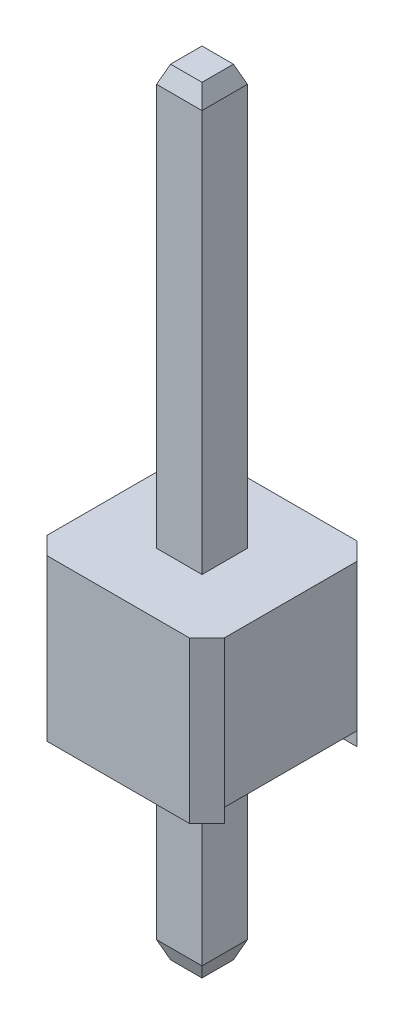
ISO-10303-21;
HEADER;
FILE_DESCRIPTION(('STEP AP214'),'2;1');
FILE_NAME('part.step','',(''),(''),'','','');
FILE_SCHEMA(('AUTOMOTIVE_DESIGN { 1 0 10303 214 1 1 1 1 }'));
ENDSEC;
DATA;
#1=APPLICATION_CONTEXT('core data for automotive mechanical design processes');
#2=APPLICATION_PROTOCOL_DEFINITION('international standard','automotive_design',2000,#1);
#3=PRODUCT_CONTEXT('',#1,'mechanical');
#4=PRODUCT('Part','Part','',(#3));
#5=PRODUCT_RELATED_PRODUCT_CATEGORY('part','',(#4));
#6=PRODUCT_DEFINITION_FORMATION('','',#4);
#7=PRODUCT_DEFINITION_CONTEXT('part definition',#1,'design');
#8=PRODUCT_DEFINITION('design','',#6,#7);
#9=PRODUCT_DEFINITION_SHAPE('','',#8);
#10=(LENGTH_UNIT() NAMED_UNIT(*) SI_UNIT(.MILLI.,.METRE.));
#11=(NAMED_UNIT(*) PLANE_ANGLE_UNIT() SI_UNIT($,.RADIAN.));
#12=(NAMED_UNIT(*) SI_UNIT($,.STERADIAN.) SOLID_ANGLE_UNIT());
#13=UNCERTAINTY_MEASURE_WITH_UNIT(LENGTH_MEASURE(1.E-05),#10,'distance_accuracy_value','');
#14=(GEOMETRIC_REPRESENTATION_CONTEXT(3) GLOBAL_UNCERTAINTY_ASSIGNED_CONTEXT((#13)) GLOBAL_UNIT_ASSIGNED_CONTEXT((#10,
#11,#12)) REPRESENTATION_CONTEXT('',''));
#15=CARTESIAN_POINT('',(0.,0.,0.));
#16=DIRECTION('',(0.,0.,1.));
#17=DIRECTION('',(1.,0.,0.));
#18=AXIS2_PLACEMENT_3D('',#15,#16,#17);
#19=CARTESIAN_POINT('',(-4.405,3.2,1.275));
#20=DIRECTION('',(0.,1.,0.));
#21=DIRECTION('',(0.,0.,1.));
#22=AXIS2_PLACEMENT_3D('',#19,#20,#21);
#23=PLANE('',#22);
#24=DIRECTION('',(0.,0.,-1.));
#25=VECTOR('',#24,1.);
#26=CARTESIAN_POINT('',(-0.945,3.2,-0.875));
#27=LINE('',#26,#25);
#28=CARTESIAN_POINT('',(-0.945000000000002,3.2,1.275));
#29=VERTEX_POINT('',#28);
#30=CARTESIAN_POINT('',(-0.945000000000005,3.2,-0.624999999999996));
#31=VERTEX_POINT('',#30);
#32=EDGE_CURVE('E232',#29,#31,#27,.T.);
#33=ORIENTED_EDGE('',*,*,#32,.T.);
#34=DIRECTION('',(1.,0.,0.));
#35=VECTOR('',#34,1.);
#36=CARTESIAN_POINT('',(-4.405,3.2,-0.624999999999996));
#37=LINE('',#36,#35);
#38=CARTESIAN_POINT('',(1.595,3.2,-0.624999999999996));
#39=VERTEX_POINT('',#38);
#40=EDGE_CURVE('E235',#31,#39,#37,.T.);
#41=ORIENTED_EDGE('',*,*,#40,.T.);
#42=DIRECTION('',(0.,0.,1.));
#43=VECTOR('',#42,1.);
#44=CARTESIAN_POINT('',(1.595,3.2,1.275));
#45=LINE('',#44,#43);
#46=CARTESIAN_POINT('',(1.595,3.2,1.275));
#47=VERTEX_POINT('',#46);
#48=EDGE_CURVE('E389',#39,#47,#45,.T.);
#49=ORIENTED_EDGE('',*,*,#48,.T.);
#50=DIRECTION('',(1.,0.,0.));
#51=VECTOR('',#50,1.);
#52=CARTESIAN_POINT('',(-4.405,3.2,1.275));
#53=LINE('',#52,#51);
#54=EDGE_CURVE('E305',#29,#47,#53,.T.);
#55=ORIENTED_EDGE('',*,*,#54,.F.);
#56=EDGE_LOOP('',(#33,#41,#49,#55));
#57=FACE_BOUND('',#56,.T.);
#58=DIRECTION('',(0.,0.,-1.));
#59=VECTOR('',#58,1.);
#60=CARTESIAN_POINT('',(0.,3.2,0.));
#61=LINE('',#60,#59);
#62=CARTESIAN_POINT('',(0.,3.2,0.65));
#63=VERTEX_POINT('',#62);
#64=CARTESIAN_POINT('',(0.,3.2,0.));
#65=VERTEX_POINT('',#64);
#66=EDGE_CURVE('E194',#63,#65,#61,.T.);
#67=ORIENTED_EDGE('',*,*,#66,.F.);
#68=DIRECTION('',(-1.,0.,0.));
#69=VECTOR('',#68,1.);
#70=CARTESIAN_POINT('',(0.,3.2,0.65));
#71=LINE('',#70,#69);
#72=CARTESIAN_POINT('',(0.65,3.2,0.65));
#73=VERTEX_POINT('',#72);
#74=EDGE_CURVE('E202',#73,#63,#71,.T.);
#75=ORIENTED_EDGE('',*,*,#74,.F.);
#76=DIRECTION('',(0.,0.,1.));
#77=VECTOR('',#76,1.);
#78=CARTESIAN_POINT('',(0.65,3.2,0.));
#79=LINE('',#78,#77);
#80=CARTESIAN_POINT('',(0.65,3.2,0.));
#81=VERTEX_POINT('',#80);
#82=EDGE_CURVE('E215',#81,#73,#79,.T.);
#83=ORIENTED_EDGE('',*,*,#82,.F.);
#84=DIRECTION('',(1.,0.,0.));
#85=VECTOR('',#84,1.);
#86=CARTESIAN_POINT('',(0.,3.2,0.));
#87=LINE('',#86,#85);
#88=EDGE_CURVE('E210',#65,#81,#87,.T.);
#89=ORIENTED_EDGE('',*,*,#88,.F.);
#90=EDGE_LOOP('',(#67,#75,#83,#89));
#91=FACE_BOUND('',#90,.T.);
#92=ADVANCED_FACE('F40',(#57,#91),#23,.F.);
#93=CARTESIAN_POINT('',(0.,3.,0.));
#94=DIRECTION('',(0.,-1.,0.));
#95=DIRECTION('',(0.,0.,-1.));
#96=AXIS2_PLACEMENT_3D('',#93,#94,#95);
#97=PLANE('',#96);
#98=DIRECTION('',(1.,0.,0.));
#99=VECTOR('',#98,1.);
#100=CARTESIAN_POINT('',(-4.405,3.,1.275));
#101=LINE('',#100,#99);
#102=CARTESIAN_POINT('',(-0.945000000000002,3.,1.275));
#103=VERTEX_POINT('',#102);
#104=CARTESIAN_POINT('',(1.595,3.,1.275));
#105=VERTEX_POINT('',#104);
#106=EDGE_CURVE('E231',#103,#105,#101,.T.);
#107=ORIENTED_EDGE('',*,*,#106,.T.);
#108=DIRECTION('',(0.70710678118655,0.,-0.707106781186545));
#109=VECTOR('',#108,1.);
#110=CARTESIAN_POINT('',(1.43499999999999,3.,1.435));
#111=LINE('',#110,#109);
#112=CARTESIAN_POINT('',(1.345,3.,1.525));
#113=VERTEX_POINT('',#112);
#114=EDGE_CURVE('E292',#105,#113,#111,.F.);
#115=ORIENTED_EDGE('',*,*,#114,.T.);
#116=DIRECTION('',(-1.,0.,0.));
#117=VECTOR('',#116,1.);
#118=CARTESIAN_POINT('',(1.595,3.,1.525));
#119=LINE('',#118,#117);
#120=CARTESIAN_POINT('',(-0.695,3.,1.525));
#121=VERTEX_POINT('',#120);
#122=EDGE_CURVE('E291',#113,#121,#119,.T.);
#123=ORIENTED_EDGE('',*,*,#122,.T.);
#124=DIRECTION('',(0.707106781186548,0.,0.707106781186548));
#125=VECTOR('',#124,1.);
#126=CARTESIAN_POINT('',(-1.11,3.,1.11));
#127=LINE('',#126,#125);
#128=EDGE_CURVE('E286',#121,#103,#127,.F.);
#129=ORIENTED_EDGE('',*,*,#128,.T.);
#130=EDGE_LOOP('',(#107,#115,#123,#129));
#131=FACE_BOUND('',#130,.T.);
#132=ADVANCED_FACE('F464',(#131),#97,.T.);
#133=CARTESIAN_POINT('',(0.,11.3,0.));
#134=DIRECTION('',(1.,0.,0.));
#135=DIRECTION('',(0.,0.,-1.));
#136=AXIS2_PLACEMENT_3D('',#133,#134,#135);
#137=PLANE('',#136);
#138=DIRECTION('',(0.,0.,-1.));
#139=VECTOR('',#138,1.);
#140=CARTESIAN_POINT('',(0.,5.3,0.));
#141=LINE('',#140,#139);
#142=CARTESIAN_POINT('',(0.,5.3,0.65));
#143=VERTEX_POINT('',#142);
#144=CARTESIAN_POINT('',(0.,5.3,0.));
#145=VERTEX_POINT('',#144);
#146=EDGE_CURVE('E310',#143,#145,#141,.T.);
#147=ORIENTED_EDGE('',*,*,#146,.F.);
#148=DIRECTION('',(0.,-1.,0.));
#149=VECTOR('',#148,1.);
#150=CARTESIAN_POINT('',(0.,11.3,0.65));
#151=LINE('',#150,#149);
#152=CARTESIAN_POINT('',(0.,11.05,0.65));
#153=VERTEX_POINT('',#152);
#154=EDGE_CURVE('E331',#153,#143,#151,.T.);
#155=ORIENTED_EDGE('',*,*,#154,.F.);
#156=DIRECTION('',(0.,0.,-1.));
#157=VECTOR('',#156,1.);
#158=CARTESIAN_POINT('',(0.,11.05,0.));
#159=LINE('',#158,#157);
#160=CARTESIAN_POINT('',(0.,11.05,0.));
#161=VERTEX_POINT('',#160);
#162=EDGE_CURVE('E290',#153,#161,#159,.T.);
#163=ORIENTED_EDGE('',*,*,#162,.T.);
#164=DIRECTION('',(0.,-1.,0.));
#165=VECTOR('',#164,1.);
#166=CARTESIAN_POINT('',(0.,11.3,0.));
#167=LINE('',#166,#165);
#168=EDGE_CURVE('E327',#161,#145,#167,.T.);
#169=ORIENTED_EDGE('',*,*,#168,.T.);
#170=EDGE_LOOP('',(#147,#155,#163,#169));
#171=FACE_BOUND('',#170,.T.);
#172=ADVANCED_FACE('F469',(#171),#137,.F.);
#173=CARTESIAN_POINT('',(0.,11.3,0.65));
#174=DIRECTION('',(0.,0.,-1.));
#175=DIRECTION('',(-1.,0.,0.));
#176=AXIS2_PLACEMENT_3D('',#173,#174,#175);
#177=PLANE('',#176);
#178=DIRECTION('',(-1.,0.,0.));
#179=VECTOR('',#178,1.);
#180=CARTESIAN_POINT('',(0.,5.3,0.65));
#181=LINE('',#180,#179);
#182=CARTESIAN_POINT('',(0.65,5.3,0.65));
#183=VERTEX_POINT('',#182);
#184=EDGE_CURVE('E272',#183,#143,#181,.T.);
#185=ORIENTED_EDGE('',*,*,#184,.F.);
#186=DIRECTION('',(0.,-1.,0.));
#187=VECTOR('',#186,1.);
#188=CARTESIAN_POINT('',(0.65,11.3,0.65));
#189=LINE('',#188,#187);
#190=CARTESIAN_POINT('',(0.65,11.05,0.65));
#191=VERTEX_POINT('',#190);
#192=EDGE_CURVE('E335',#191,#183,#189,.T.);
#193=ORIENTED_EDGE('',*,*,#192,.F.);
#194=DIRECTION('',(-1.,0.,0.));
#195=VECTOR('',#194,1.);
#196=CARTESIAN_POINT('',(0.,11.05,0.65));
#197=LINE('',#196,#195);
#198=EDGE_CURVE('E328',#191,#153,#197,.T.);
#199=ORIENTED_EDGE('',*,*,#198,.T.);
#200=ORIENTED_EDGE('',*,*,#154,.T.);
#201=EDGE_LOOP('',(#185,#193,#199,#200));
#202=FACE_BOUND('',#201,.T.);
#203=ADVANCED_FACE('F479',(#202),#177,.F.);
#204=CARTESIAN_POINT('',(0.65,11.3,0.));
#205=DIRECTION('',(-1.,0.,0.));
#206=DIRECTION('',(0.,0.,1.));
#207=AXIS2_PLACEMENT_3D('',#204,#205,#206);
#208=PLANE('',#207);
#209=DIRECTION('',(0.,0.,1.));
#210=VECTOR('',#209,1.);
#211=CARTESIAN_POINT('',(0.65,5.3,0.));
#212=LINE('',#211,#210);
#213=CARTESIAN_POINT('',(0.65,5.3,0.));
#214=VERTEX_POINT('',#213);
#215=EDGE_CURVE('E285',#214,#183,#212,.T.);
#216=ORIENTED_EDGE('',*,*,#215,.F.);
#217=DIRECTION('',(0.,-1.,0.));
#218=VECTOR('',#217,1.);
#219=CARTESIAN_POINT('',(0.65,11.3,0.));
#220=LINE('',#219,#218);
#221=CARTESIAN_POINT('',(0.65,11.05,0.));
#222=VERTEX_POINT('',#221);
#223=EDGE_CURVE('E340',#222,#214,#220,.T.);
#224=ORIENTED_EDGE('',*,*,#223,.F.);
#225=DIRECTION('',(0.,0.,1.));
#226=VECTOR('',#225,1.);
#227=CARTESIAN_POINT('',(0.65,11.05,0.65));
#228=LINE('',#227,#226);
#229=EDGE_CURVE('E332',#222,#191,#228,.T.);
#230=ORIENTED_EDGE('',*,*,#229,.T.);
#231=ORIENTED_EDGE('',*,*,#192,.T.);
#232=EDGE_LOOP('',(#216,#224,#230,#231));
#233=FACE_BOUND('',#232,.T.);
#234=ADVANCED_FACE('F483',(#233),#208,.F.);
#235=CARTESIAN_POINT('',(0.,11.3,0.));
#236=DIRECTION('',(0.,0.,1.));
#237=DIRECTION('',(1.,0.,0.));
#238=AXIS2_PLACEMENT_3D('',#235,#236,#237);
#239=PLANE('',#238);
#240=DIRECTION('',(1.,0.,0.));
#241=VECTOR('',#240,1.);
#242=CARTESIAN_POINT('',(0.,5.3,0.));
#243=LINE('',#242,#241);
#244=EDGE_CURVE('E306',#145,#214,#243,.T.);
#245=ORIENTED_EDGE('',*,*,#244,.F.);
#246=ORIENTED_EDGE('',*,*,#168,.F.);
#247=DIRECTION('',(1.,0.,0.));
#248=VECTOR('',#247,1.);
#249=CARTESIAN_POINT('',(0.65,11.05,0.));
#250=LINE('',#249,#248);
#251=EDGE_CURVE('E336',#161,#222,#250,.T.);
#252=ORIENTED_EDGE('',*,*,#251,.T.);
#253=ORIENTED_EDGE('',*,*,#223,.T.);
#254=EDGE_LOOP('',(#245,#246,#252,#253));
#255=FACE_BOUND('',#254,.T.);
#256=ADVANCED_FACE('F487',(#255),#239,.F.);
#257=CARTESIAN_POINT('',(0.,11.3,0.));
#258=DIRECTION('',(0.,1.,0.));
#259=DIRECTION('',(0.,0.,1.));
#260=AXIS2_PLACEMENT_3D('',#257,#258,#259);
#261=PLANE('',#260);
#262=DIRECTION('',(0.,0.,-1.));
#263=VECTOR('',#262,1.);
#264=CARTESIAN_POINT('',(0.55,11.3,0.));
#265=LINE('',#264,#263);
#266=CARTESIAN_POINT('',(0.55,11.3,0.55));
#267=VERTEX_POINT('',#266);
#268=CARTESIAN_POINT('',(0.55,11.3,0.1));
#269=VERTEX_POINT('',#268);
#270=EDGE_CURVE('E346',#267,#269,#265,.T.);
#271=ORIENTED_EDGE('',*,*,#270,.T.);
#272=DIRECTION('',(-1.,0.,0.));
#273=VECTOR('',#272,1.);
#274=CARTESIAN_POINT('',(0.,11.3,0.1));
#275=LINE('',#274,#273);
#276=CARTESIAN_POINT('',(0.1,11.3,0.1));
#277=VERTEX_POINT('',#276);
#278=EDGE_CURVE('E341',#269,#277,#275,.T.);
#279=ORIENTED_EDGE('',*,*,#278,.T.);
#280=DIRECTION('',(0.,0.,1.));
#281=VECTOR('',#280,1.);
#282=CARTESIAN_POINT('',(0.1,11.3,0.65));
#283=LINE('',#282,#281);
#284=CARTESIAN_POINT('',(0.1,11.3,0.55));
#285=VERTEX_POINT('',#284);
#286=EDGE_CURVE('E345',#277,#285,#283,.T.);
#287=ORIENTED_EDGE('',*,*,#286,.T.);
#288=DIRECTION('',(1.,0.,0.));
#289=VECTOR('',#288,1.);
#290=CARTESIAN_POINT('',(0.65,11.3,0.55));
#291=LINE('',#290,#289);
#292=EDGE_CURVE('E316',#285,#267,#291,.T.);
#293=ORIENTED_EDGE('',*,*,#292,.T.);
#294=EDGE_LOOP('',(#271,#279,#287,#293));
#295=FACE_BOUND('',#294,.T.);
#296=ADVANCED_FACE('F491',(#295),#261,.T.);
#297=CARTESIAN_POINT('',(0.,11.3,0.55));
#298=DIRECTION('',(0.,0.371390676354102,0.92847669088526));
#299=DIRECTION('',(-1.,0.,0.));
#300=AXIS2_PLACEMENT_3D('',#297,#298,#299);
#301=PLANE('',#300);
#302=DIRECTION('',(0.348155311911394,0.87038827977849,-0.348155311911394));
#303=VECTOR('',#302,1.);
#304=CARTESIAN_POINT('',(0.166666666666666,11.4666666666667,0.483333333333334));
#305=LINE('',#304,#303);
#306=EDGE_CURVE('E315',#153,#285,#305,.T.);
#307=ORIENTED_EDGE('',*,*,#306,.F.);
#308=ORIENTED_EDGE('',*,*,#198,.F.);
#309=DIRECTION('',(-0.348155311911394,0.87038827977849,-0.348155311911394));
#310=VECTOR('',#309,1.);
#311=CARTESIAN_POINT('',(0.483333333333334,11.4666666666667,0.483333333333334));
#312=LINE('',#311,#310);
#313=EDGE_CURVE('E311',#267,#191,#312,.F.);
#314=ORIENTED_EDGE('',*,*,#313,.F.);
#315=ORIENTED_EDGE('',*,*,#292,.F.);
#316=EDGE_LOOP('',(#307,#308,#314,#315));
#317=FACE_BOUND('',#316,.T.);
#318=ADVANCED_FACE('F651',(#317),#301,.T.);
#319=CARTESIAN_POINT('',(0.55,11.3,0.));
#320=DIRECTION('',(0.92847669088526,0.371390676354102,0.));
#321=DIRECTION('',(0.,0.,1.));
#322=AXIS2_PLACEMENT_3D('',#319,#320,#321);
#323=PLANE('',#322);
#324=ORIENTED_EDGE('',*,*,#313,.T.);
#325=ORIENTED_EDGE('',*,*,#229,.F.);
#326=DIRECTION('',(-0.348155311911394,0.87038827977849,0.348155311911394));
#327=VECTOR('',#326,1.);
#328=CARTESIAN_POINT('',(0.562121212121212,11.269696969697,0.0878787878787882));
#329=LINE('',#328,#327);
#330=EDGE_CURVE('E320',#269,#222,#329,.F.);
#331=ORIENTED_EDGE('',*,*,#330,.F.);
#332=ORIENTED_EDGE('',*,*,#270,.F.);
#333=EDGE_LOOP('',(#324,#325,#331,#332));
#334=FACE_BOUND('',#333,.T.);
#335=ADVANCED_FACE('F642',(#334),#323,.T.);
#336=CARTESIAN_POINT('',(0.1,11.3,0.));
#337=DIRECTION('',(-0.92847669088526,0.371390676354102,0.));
#338=DIRECTION('',(0.,0.,-1.));
#339=AXIS2_PLACEMENT_3D('',#336,#337,#338);
#340=PLANE('',#339);
#341=ORIENTED_EDGE('',*,*,#306,.T.);
#342=ORIENTED_EDGE('',*,*,#286,.F.);
#343=DIRECTION('',(-0.348155311911394,-0.87038827977849,-0.348155311911394));
#344=VECTOR('',#343,1.);
#345=CARTESIAN_POINT('',(0.0878787878787882,11.269696969697,0.0878787878787882));
#346=LINE('',#345,#344);
#347=EDGE_CURVE('E263',#161,#277,#346,.F.);
#348=ORIENTED_EDGE('',*,*,#347,.F.);
#349=ORIENTED_EDGE('',*,*,#162,.F.);
#350=EDGE_LOOP('',(#341,#342,#348,#349));
#351=FACE_BOUND('',#350,.T.);
#352=ADVANCED_FACE('F633',(#351),#340,.T.);
#353=CARTESIAN_POINT('',(0.,11.3,0.1));
#354=DIRECTION('',(0.,0.371390676354102,-0.92847669088526));
#355=DIRECTION('',(1.,0.,0.));
#356=AXIS2_PLACEMENT_3D('',#353,#354,#355);
#357=PLANE('',#356);
#358=ORIENTED_EDGE('',*,*,#330,.T.);
#359=ORIENTED_EDGE('',*,*,#251,.F.);
#360=ORIENTED_EDGE('',*,*,#347,.T.);
#361=ORIENTED_EDGE('',*,*,#278,.F.);
#362=EDGE_LOOP('',(#358,#359,#360,#361));
#363=FACE_BOUND('',#362,.T.);
#364=ADVANCED_FACE('F624',(#363),#357,.T.);
#365=CARTESIAN_POINT('',(0.,5.3,0.));
#366=DIRECTION('',(0.,-1.,0.));
#367=DIRECTION('',(0.,0.,-1.));
#368=AXIS2_PLACEMENT_3D('',#365,#366,#367);
#369=PLANE('',#368);
#370=DIRECTION('',(1.,0.,0.));
#371=VECTOR('',#370,1.);
#372=CARTESIAN_POINT('',(1.595,5.3,-0.875));
#373=LINE('',#372,#371);
#374=CARTESIAN_POINT('',(-0.695000000000001,5.3,-0.875));
#375=VERTEX_POINT('',#374);
#376=CARTESIAN_POINT('',(1.345,5.3,-0.875));
#377=VERTEX_POINT('',#376);
#378=EDGE_CURVE('E275',#375,#377,#373,.T.);
#379=ORIENTED_EDGE('',*,*,#378,.F.);
#380=DIRECTION('',(0.707106781186548,0.,-0.707106781186548));
#381=VECTOR('',#380,1.);
#382=CARTESIAN_POINT('',(-0.945,5.3,-0.625000000000001));
#383=LINE('',#382,#381);
#384=CARTESIAN_POINT('',(-0.945,5.3,-0.625000000000001));
#385=VERTEX_POINT('',#384);
#386=EDGE_CURVE('E259',#375,#385,#383,.F.);
#387=ORIENTED_EDGE('',*,*,#386,.T.);
#388=DIRECTION('',(0.,0.,-1.));
#389=VECTOR('',#388,1.);
#390=CARTESIAN_POINT('',(-0.945,5.3,-0.875));
#391=LINE('',#390,#389);
#392=CARTESIAN_POINT('',(-0.945,5.3,1.275));
#393=VERTEX_POINT('',#392);
#394=EDGE_CURVE('E302',#393,#385,#391,.T.);
#395=ORIENTED_EDGE('',*,*,#394,.F.);
#396=DIRECTION('',(-0.707106781186548,0.,-0.707106781186548));
#397=VECTOR('',#396,1.);
#398=CARTESIAN_POINT('',(-0.695,5.3,1.525));
#399=LINE('',#398,#397);
#400=CARTESIAN_POINT('',(-0.695,5.3,1.525));
#401=VERTEX_POINT('',#400);
#402=EDGE_CURVE('E262',#393,#401,#399,.F.);
#403=ORIENTED_EDGE('',*,*,#402,.T.);
#404=DIRECTION('',(-1.,0.,0.));
#405=VECTOR('',#404,1.);
#406=CARTESIAN_POINT('',(1.595,5.3,1.525));
#407=LINE('',#406,#405);
#408=CARTESIAN_POINT('',(1.345,5.3,1.525));
#409=VERTEX_POINT('',#408);
#410=EDGE_CURVE('E255',#409,#401,#407,.T.);
#411=ORIENTED_EDGE('',*,*,#410,.F.);
#412=DIRECTION('',(-0.70710678118655,0.,0.707106781186545));
#413=VECTOR('',#412,1.);
#414=CARTESIAN_POINT('',(1.595,5.3,1.275));
#415=LINE('',#414,#413);
#416=CARTESIAN_POINT('',(1.595,5.3,1.275));
#417=VERTEX_POINT('',#416);
#418=EDGE_CURVE('E266',#409,#417,#415,.F.);
#419=ORIENTED_EDGE('',*,*,#418,.T.);
#420=DIRECTION('',(0.,0.,1.));
#421=VECTOR('',#420,1.);
#422=CARTESIAN_POINT('',(1.595,5.3,-0.875));
#423=LINE('',#422,#421);
#424=CARTESIAN_POINT('',(1.595,5.3,-0.624999999999996));
#425=VERTEX_POINT('',#424);
#426=EDGE_CURVE('E242',#425,#417,#423,.T.);
#427=ORIENTED_EDGE('',*,*,#426,.F.);
#428=DIRECTION('',(0.707106781186545,0.,0.70710678118655));
#429=VECTOR('',#428,1.);
#430=CARTESIAN_POINT('',(1.345,5.3,-0.875));
#431=LINE('',#430,#429);
#432=EDGE_CURVE('E269',#425,#377,#431,.F.);
#433=ORIENTED_EDGE('',*,*,#432,.T.);
#434=EDGE_LOOP('',(#379,#387,#395,#403,#411,#419,#427,#433));
#435=FACE_BOUND('',#434,.T.);
#436=ORIENTED_EDGE('',*,*,#184,.T.);
#437=ORIENTED_EDGE('',*,*,#146,.T.);
#438=ORIENTED_EDGE('',*,*,#244,.T.);
#439=ORIENTED_EDGE('',*,*,#215,.T.);
#440=EDGE_LOOP('',(#436,#437,#438,#439));
#441=FACE_BOUND('',#440,.T.);
#442=ADVANCED_FACE('F616',(#435,#441),#369,.F.);
#443=DIRECTION('',(1.,0.,0.));
#444=VECTOR('',#443,1.);
#445=CARTESIAN_POINT('',(-4.405,3.,-0.624999999999996));
#446=LINE('',#445,#444);
#447=CARTESIAN_POINT('',(-0.945000000000005,3.,-0.624999999999996));
#448=VERTEX_POINT('',#447);
#449=CARTESIAN_POINT('',(1.595,3.,-0.624999999999996));
#450=VERTEX_POINT('',#449);
#451=EDGE_CURVE('E248',#448,#450,#446,.T.);
#452=ORIENTED_EDGE('',*,*,#451,.F.);
#453=DIRECTION('',(-0.707106781186548,0.,0.707106781186548));
#454=VECTOR('',#453,1.);
#455=CARTESIAN_POINT('',(-0.785000000000001,3.,-0.785000000000001));
#456=LINE('',#455,#454);
#457=CARTESIAN_POINT('',(-0.695000000000001,3.,-0.875));
#458=VERTEX_POINT('',#457);
#459=EDGE_CURVE('E281',#448,#458,#456,.F.);
#460=ORIENTED_EDGE('',*,*,#459,.T.);
#461=DIRECTION('',(1.,0.,0.));
#462=VECTOR('',#461,1.);
#463=CARTESIAN_POINT('',(1.595,3.,-0.875));
#464=LINE('',#463,#462);
#465=CARTESIAN_POINT('',(1.345,3.,-0.875));
#466=VERTEX_POINT('',#465);
#467=EDGE_CURVE('E284',#458,#466,#464,.T.);
#468=ORIENTED_EDGE('',*,*,#467,.T.);
#469=DIRECTION('',(-0.707106781186545,0.,-0.70710678118655));
#470=VECTOR('',#469,1.);
#471=CARTESIAN_POINT('',(1.11,3.,-1.11));
#472=LINE('',#471,#470);
#473=EDGE_CURVE('E294',#466,#450,#472,.F.);
#474=ORIENTED_EDGE('',*,*,#473,.T.);
#475=EDGE_LOOP('',(#452,#460,#468,#474));
#476=FACE_BOUND('',#475,.T.);
#477=ADVANCED_FACE('F472',(#476),#97,.T.);
#478=CARTESIAN_POINT('',(1.595,5.3,-0.875));
#479=DIRECTION('',(1.,0.,0.));
#480=DIRECTION('',(0.,0.,-1.));
#481=AXIS2_PLACEMENT_3D('',#478,#479,#480);
#482=PLANE('',#481);
#483=ORIENTED_EDGE('',*,*,#48,.F.);
#484=DIRECTION('',(0.,1.,0.));
#485=VECTOR('',#484,1.);
#486=CARTESIAN_POINT('',(1.595,5.3,-0.624999999999996));
#487=LINE('',#486,#485);
#488=EDGE_CURVE('E249',#39,#425,#487,.T.);
#489=ORIENTED_EDGE('',*,*,#488,.T.);
#490=ORIENTED_EDGE('',*,*,#426,.T.);
#491=DIRECTION('',(0.,-1.,0.));
#492=VECTOR('',#491,1.);
#493=CARTESIAN_POINT('',(1.595,5.3,1.275));
#494=LINE('',#493,#492);
#495=EDGE_CURVE('E237',#417,#47,#494,.T.);
#496=ORIENTED_EDGE('',*,*,#495,.T.);
#497=EDGE_LOOP('',(#483,#489,#490,#496));
#498=FACE_BOUND('',#497,.T.);
#499=ADVANCED_FACE('F599',(#498),#482,.T.);
#500=CARTESIAN_POINT('',(1.595,5.3,-0.875));
#501=DIRECTION('',(0.,0.,-1.));
#502=DIRECTION('',(-1.,0.,0.));
#503=AXIS2_PLACEMENT_3D('',#500,#501,#502);
#504=PLANE('',#503);
#505=ORIENTED_EDGE('',*,*,#467,.F.);
#506=DIRECTION('',(0.,1.,0.));
#507=VECTOR('',#506,1.);
#508=CARTESIAN_POINT('',(-0.695000000000001,5.3,-0.875));
#509=LINE('',#508,#507);
#510=EDGE_CURVE('E241',#458,#375,#509,.T.);
#511=ORIENTED_EDGE('',*,*,#510,.T.);
#512=ORIENTED_EDGE('',*,*,#378,.T.);
#513=DIRECTION('',(0.,-1.,0.));
#514=VECTOR('',#513,1.);
#515=CARTESIAN_POINT('',(1.345,5.3,-0.875));
#516=LINE('',#515,#514);
#517=EDGE_CURVE('E276',#377,#466,#516,.T.);
#518=ORIENTED_EDGE('',*,*,#517,.T.);
#519=EDGE_LOOP('',(#505,#511,#512,#518));
#520=FACE_BOUND('',#519,.T.);
#521=ADVANCED_FACE('F590',(#520),#504,.T.);
#522=CARTESIAN_POINT('',(-0.945,5.3,-0.875));
#523=DIRECTION('',(-1.,0.,0.));
#524=DIRECTION('',(0.,0.,1.));
#525=AXIS2_PLACEMENT_3D('',#522,#523,#524);
#526=PLANE('',#525);
#527=ORIENTED_EDGE('',*,*,#32,.F.);
#528=DIRECTION('',(0.,1.,0.));
#529=VECTOR('',#528,1.);
#530=CARTESIAN_POINT('',(-0.945,5.3,1.275));
#531=LINE('',#530,#529);
#532=EDGE_CURVE('E280',#29,#393,#531,.T.);
#533=ORIENTED_EDGE('',*,*,#532,.T.);
#534=ORIENTED_EDGE('',*,*,#394,.T.);
#535=DIRECTION('',(0.,-1.,0.));
#536=VECTOR('',#535,1.);
#537=CARTESIAN_POINT('',(-0.945,5.3,-0.625000000000001));
#538=LINE('',#537,#536);
#539=EDGE_CURVE('E298',#385,#31,#538,.T.);
#540=ORIENTED_EDGE('',*,*,#539,.T.);
#541=EDGE_LOOP('',(#527,#533,#534,#540));
#542=FACE_BOUND('',#541,.T.);
#543=ADVANCED_FACE('F581',(#542),#526,.T.);
#544=CARTESIAN_POINT('',(1.595,5.3,1.525));
#545=DIRECTION('',(0.,0.,1.));
#546=DIRECTION('',(1.,0.,0.));
#547=AXIS2_PLACEMENT_3D('',#544,#545,#546);
#548=PLANE('',#547);
#549=ORIENTED_EDGE('',*,*,#410,.T.);
#550=DIRECTION('',(0.,-1.,0.));
#551=VECTOR('',#550,1.);
#552=CARTESIAN_POINT('',(-0.695,5.3,1.525));
#553=LINE('',#552,#551);
#554=EDGE_CURVE('E250',#401,#121,#553,.T.);
#555=ORIENTED_EDGE('',*,*,#554,.T.);
#556=ORIENTED_EDGE('',*,*,#122,.F.);
#557=DIRECTION('',(0.,1.,0.));
#558=VECTOR('',#557,1.);
#559=CARTESIAN_POINT('',(1.345,5.3,1.525));
#560=LINE('',#559,#558);
#561=EDGE_CURVE('E254',#113,#409,#560,.T.);
#562=ORIENTED_EDGE('',*,*,#561,.T.);
#563=EDGE_LOOP('',(#549,#555,#556,#562));
#564=FACE_BOUND('',#563,.T.);
#565=ADVANCED_FACE('F572',(#564),#548,.T.);
#566=CARTESIAN_POINT('',(-0.945,5.3,-0.625000000000001));
#567=DIRECTION('',(0.707106781186547,0.,0.707106781186547));
#568=DIRECTION('',(0.,-1.,0.));
#569=AXIS2_PLACEMENT_3D('',#566,#567,#568);
#570=PLANE('',#569);
#571=ORIENTED_EDGE('',*,*,#386,.F.);
#572=ORIENTED_EDGE('',*,*,#510,.F.);
#573=ORIENTED_EDGE('',*,*,#459,.F.);
#574=DIRECTION('',(0.,1.,0.));
#575=VECTOR('',#574,1.);
#576=CARTESIAN_POINT('',(-0.945000000000005,5.3,-0.624999999999996));
#577=LINE('',#576,#575);
#578=EDGE_CURVE('E258',#31,#448,#577,.F.);
#579=ORIENTED_EDGE('',*,*,#578,.F.);
#580=ORIENTED_EDGE('',*,*,#539,.F.);
#581=EDGE_LOOP('',(#571,#572,#573,#579,#580));
#582=FACE_BOUND('',#581,.T.);
#583=ADVANCED_FACE('F563',(#582),#570,.F.);
#584=CARTESIAN_POINT('',(-0.695,5.3,1.525));
#585=DIRECTION('',(0.707106781186547,0.,-0.707106781186547));
#586=DIRECTION('',(0.,-1.,0.));
#587=AXIS2_PLACEMENT_3D('',#584,#585,#586);
#588=PLANE('',#587);
#589=ORIENTED_EDGE('',*,*,#402,.F.);
#590=ORIENTED_EDGE('',*,*,#532,.F.);
#591=EDGE_CURVE('E247',#103,#29,#531,.T.);
#592=ORIENTED_EDGE('',*,*,#591,.F.);
#593=ORIENTED_EDGE('',*,*,#128,.F.);
#594=ORIENTED_EDGE('',*,*,#554,.F.);
#595=EDGE_LOOP('',(#589,#590,#592,#593,#594));
#596=FACE_BOUND('',#595,.T.);
#597=ADVANCED_FACE('F554',(#596),#588,.F.);
#598=CARTESIAN_POINT('',(1.595,5.3,1.275));
#599=DIRECTION('',(-0.707106781186545,0.,-0.70710678118655));
#600=DIRECTION('',(0.,-1.,0.));
#601=AXIS2_PLACEMENT_3D('',#598,#599,#600);
#602=PLANE('',#601);
#603=ORIENTED_EDGE('',*,*,#418,.F.);
#604=ORIENTED_EDGE('',*,*,#561,.F.);
#605=ORIENTED_EDGE('',*,*,#114,.F.);
#606=DIRECTION('',(0.,-1.,0.));
#607=VECTOR('',#606,1.);
#608=CARTESIAN_POINT('',(1.595,3.,1.275));
#609=LINE('',#608,#607);
#610=EDGE_CURVE('E236',#47,#105,#609,.T.);
#611=ORIENTED_EDGE('',*,*,#610,.F.);
#612=ORIENTED_EDGE('',*,*,#495,.F.);
#613=EDGE_LOOP('',(#603,#604,#605,#611,#612));
#614=FACE_BOUND('',#613,.T.);
#615=ADVANCED_FACE('F545',(#614),#602,.F.);
#616=CARTESIAN_POINT('',(1.345,5.3,-0.875));
#617=DIRECTION('',(-0.70710678118655,0.,0.707106781186545));
#618=DIRECTION('',(0.,-1.,0.));
#619=AXIS2_PLACEMENT_3D('',#616,#617,#618);
#620=PLANE('',#619);
#621=ORIENTED_EDGE('',*,*,#432,.F.);
#622=ORIENTED_EDGE('',*,*,#488,.F.);
#623=EDGE_CURVE('E243',#450,#39,#487,.T.);
#624=ORIENTED_EDGE('',*,*,#623,.F.);
#625=ORIENTED_EDGE('',*,*,#473,.F.);
#626=ORIENTED_EDGE('',*,*,#517,.F.);
#627=EDGE_LOOP('',(#621,#622,#624,#625,#626));
#628=FACE_BOUND('',#627,.T.);
#629=ADVANCED_FACE('F537',(#628),#620,.F.);
#630=CARTESIAN_POINT('',(-4.405,3.,-0.624999999999996));
#631=DIRECTION('',(0.,0.,-1.));
#632=DIRECTION('',(-1.,0.,0.));
#633=AXIS2_PLACEMENT_3D('',#630,#631,#632);
#634=PLANE('',#633);
#635=ORIENTED_EDGE('',*,*,#578,.T.);
#636=ORIENTED_EDGE('',*,*,#451,.T.);
#637=ORIENTED_EDGE('',*,*,#623,.T.);
#638=ORIENTED_EDGE('',*,*,#40,.F.);
#639=EDGE_LOOP('',(#635,#636,#637,#638));
#640=FACE_BOUND('',#639,.T.);
#641=ADVANCED_FACE('F475',(#640),#634,.F.);
#642=CARTESIAN_POINT('',(-4.405,3.,1.275));
#643=DIRECTION('',(0.,0.,1.));
#644=DIRECTION('',(1.,0.,0.));
#645=AXIS2_PLACEMENT_3D('',#642,#643,#644);
#646=PLANE('',#645);
#647=ORIENTED_EDGE('',*,*,#591,.T.);
#648=ORIENTED_EDGE('',*,*,#54,.T.);
#649=ORIENTED_EDGE('',*,*,#610,.T.);
#650=ORIENTED_EDGE('',*,*,#106,.F.);
#651=EDGE_LOOP('',(#647,#648,#649,#650));
#652=FACE_BOUND('',#651,.T.);
#653=ADVANCED_FACE('F461',(#652),#646,.F.);
#654=CARTESIAN_POINT('',(0.,0.2,0.));
#655=DIRECTION('',(1.,0.,0.));
#656=DIRECTION('',(0.,0.,-1.));
#657=AXIS2_PLACEMENT_3D('',#654,#655,#656);
#658=PLANE('',#657);
#659=DIRECTION('',(0.,1.,0.));
#660=VECTOR('',#659,1.);
#661=CARTESIAN_POINT('',(0.,0.2,0.));
#662=LINE('',#661,#660);
#663=CARTESIAN_POINT('',(0.,0.450000000000002,0.));
#664=VERTEX_POINT('',#663);
#665=EDGE_CURVE('E228',#664,#65,#662,.T.);
#666=ORIENTED_EDGE('',*,*,#665,.F.);
#667=DIRECTION('',(0.,0.,1.));
#668=VECTOR('',#667,1.);
#669=CARTESIAN_POINT('',(0.,0.450000000000002,0.));
#670=LINE('',#669,#668);
#671=CARTESIAN_POINT('',(0.,0.450000000000002,0.65));
#672=VERTEX_POINT('',#671);
#673=EDGE_CURVE('E11',#664,#672,#670,.T.);
#674=ORIENTED_EDGE('',*,*,#673,.T.);
#675=DIRECTION('',(0.,1.,0.));
#676=VECTOR('',#675,1.);
#677=CARTESIAN_POINT('',(0.,0.2,0.65));
#678=LINE('',#677,#676);
#679=EDGE_CURVE('E191',#672,#63,#678,.T.);
#680=ORIENTED_EDGE('',*,*,#679,.T.);
#681=ORIENTED_EDGE('',*,*,#66,.T.);
#682=EDGE_LOOP('',(#666,#674,#680,#681));
#683=FACE_BOUND('',#682,.T.);
#684=ADVANCED_FACE('F193',(#683),#658,.F.);
#685=CARTESIAN_POINT('',(0.,0.2,0.));
#686=DIRECTION('',(0.,0.,1.));
#687=DIRECTION('',(1.,0.,0.));
#688=AXIS2_PLACEMENT_3D('',#685,#686,#687);
#689=PLANE('',#688);
#690=DIRECTION('',(0.,1.,0.));
#691=VECTOR('',#690,1.);
#692=CARTESIAN_POINT('',(0.65,0.2,0.));
#693=LINE('',#692,#691);
#694=CARTESIAN_POINT('',(0.65,0.450000000000002,0.));
#695=VERTEX_POINT('',#694);
#696=EDGE_CURVE('E225',#695,#81,#693,.T.);
#697=ORIENTED_EDGE('',*,*,#696,.F.);
#698=DIRECTION('',(-1.,0.,0.));
#699=VECTOR('',#698,1.);
#700=CARTESIAN_POINT('',(0.,0.450000000000002,0.));
#701=LINE('',#700,#699);
#702=EDGE_CURVE('E50',#695,#664,#701,.T.);
#703=ORIENTED_EDGE('',*,*,#702,.T.);
#704=ORIENTED_EDGE('',*,*,#665,.T.);
#705=ORIENTED_EDGE('',*,*,#88,.T.);
#706=EDGE_LOOP('',(#697,#703,#704,#705));
#707=FACE_BOUND('',#706,.T.);
#708=ADVANCED_FACE('F453',(#707),#689,.F.);
#709=CARTESIAN_POINT('',(0.65,0.2,0.));
#710=DIRECTION('',(-1.,0.,0.));
#711=DIRECTION('',(0.,0.,1.));
#712=AXIS2_PLACEMENT_3D('',#709,#710,#711);
#713=PLANE('',#712);
#714=DIRECTION('',(0.,1.,0.));
#715=VECTOR('',#714,1.);
#716=CARTESIAN_POINT('',(0.65,0.2,0.65));
#717=LINE('',#716,#715);
#718=CARTESIAN_POINT('',(0.65,0.450000000000002,0.65));
#719=VERTEX_POINT('',#718);
#720=EDGE_CURVE('E201',#719,#73,#717,.T.);
#721=ORIENTED_EDGE('',*,*,#720,.F.);
#722=DIRECTION('',(0.,0.,-1.));
#723=VECTOR('',#722,1.);
#724=CARTESIAN_POINT('',(0.65,0.450000000000002,0.));
#725=LINE('',#724,#723);
#726=EDGE_CURVE('E65',#719,#695,#725,.T.);
#727=ORIENTED_EDGE('',*,*,#726,.T.);
#728=ORIENTED_EDGE('',*,*,#696,.T.);
#729=ORIENTED_EDGE('',*,*,#82,.T.);
#730=EDGE_LOOP('',(#721,#727,#728,#729));
#731=FACE_BOUND('',#730,.T.);
#732=ADVANCED_FACE('F452',(#731),#713,.F.);
#733=CARTESIAN_POINT('',(0.,0.2,0.65));
#734=DIRECTION('',(0.,0.,-1.));
#735=DIRECTION('',(-1.,0.,0.));
#736=AXIS2_PLACEMENT_3D('',#733,#734,#735);
#737=PLANE('',#736);
#738=ORIENTED_EDGE('',*,*,#679,.F.);
#739=DIRECTION('',(1.,0.,0.));
#740=VECTOR('',#739,1.);
#741=CARTESIAN_POINT('',(0.,0.450000000000002,0.65));
#742=LINE('',#741,#740);
#743=EDGE_CURVE('E421',#672,#719,#742,.T.);
#744=ORIENTED_EDGE('',*,*,#743,.T.);
#745=ORIENTED_EDGE('',*,*,#720,.T.);
#746=ORIENTED_EDGE('',*,*,#74,.T.);
#747=EDGE_LOOP('',(#738,#744,#745,#746));
#748=FACE_BOUND('',#747,.T.);
#749=ADVANCED_FACE('F213',(#748),#737,.F.);
#750=CARTESIAN_POINT('',(0.,0.2,0.));
#751=DIRECTION('',(0.,1.,0.));
#752=DIRECTION('',(0.,0.,1.));
#753=AXIS2_PLACEMENT_3D('',#750,#751,#752);
#754=PLANE('',#753);
#755=DIRECTION('',(0.,0.,1.));
#756=VECTOR('',#755,1.);
#757=CARTESIAN_POINT('',(0.55,0.2,0.));
#758=LINE('',#757,#756);
#759=CARTESIAN_POINT('',(0.55,0.2,0.1));
#760=VERTEX_POINT('',#759);
#761=CARTESIAN_POINT('',(0.55,0.2,0.55));
#762=VERTEX_POINT('',#761);
#763=EDGE_CURVE('E414',#760,#762,#758,.T.);
#764=ORIENTED_EDGE('',*,*,#763,.T.);
#765=DIRECTION('',(-1.,0.,0.));
#766=VECTOR('',#765,1.);
#767=CARTESIAN_POINT('',(0.,0.2,0.55));
#768=LINE('',#767,#766);
#769=CARTESIAN_POINT('',(0.1,0.2,0.55));
#770=VERTEX_POINT('',#769);
#771=EDGE_CURVE('E417',#762,#770,#768,.T.);
#772=ORIENTED_EDGE('',*,*,#771,.T.);
#773=DIRECTION('',(0.,0.,-1.));
#774=VECTOR('',#773,1.);
#775=CARTESIAN_POINT('',(0.1,0.2,0.));
#776=LINE('',#775,#774);
#777=CARTESIAN_POINT('',(0.1,0.2,0.1));
#778=VERTEX_POINT('',#777);
#779=EDGE_CURVE('E395',#770,#778,#776,.T.);
#780=ORIENTED_EDGE('',*,*,#779,.T.);
#781=DIRECTION('',(1.,0.,0.));
#782=VECTOR('',#781,1.);
#783=CARTESIAN_POINT('',(0.,0.2,0.1));
#784=LINE('',#783,#782);
#785=EDGE_CURVE('E411',#778,#760,#784,.T.);
#786=ORIENTED_EDGE('',*,*,#785,.T.);
#787=EDGE_LOOP('',(#764,#772,#780,#786));
#788=FACE_BOUND('',#787,.T.);
#789=ADVANCED_FACE('F499',(#788),#754,.F.);
#790=CARTESIAN_POINT('',(0.,0.2,0.1));
#791=DIRECTION('',(0.,0.371390676354102,0.92847669088526));
#792=DIRECTION('',(1.,0.,0.));
#793=AXIS2_PLACEMENT_3D('',#790,#791,#792);
#794=PLANE('',#793);
#795=DIRECTION('',(0.348155311911394,-0.87038827977849,0.348155311911394));
#796=VECTOR('',#795,1.);
#797=CARTESIAN_POINT('',(0.0878787878787882,0.23030303030303,0.0878787878787882));
#798=LINE('',#797,#796);
#799=EDGE_CURVE('E432',#664,#778,#798,.T.);
#800=ORIENTED_EDGE('',*,*,#799,.F.);
#801=ORIENTED_EDGE('',*,*,#702,.F.);
#802=DIRECTION('',(-0.348155311911394,-0.87038827977849,0.348155311911394));
#803=VECTOR('',#802,1.);
#804=CARTESIAN_POINT('',(0.483333333333334,0.0333333333333339,0.166666666666666));
#805=LINE('',#804,#803);
#806=EDGE_CURVE('E44',#760,#695,#805,.F.);
#807=ORIENTED_EDGE('',*,*,#806,.F.);
#808=ORIENTED_EDGE('',*,*,#785,.F.);
#809=EDGE_LOOP('',(#800,#801,#807,#808));
#810=FACE_BOUND('',#809,.T.);
#811=ADVANCED_FACE('F42',(#810),#794,.F.);
#812=CARTESIAN_POINT('',(0.55,0.2,0.));
#813=DIRECTION('',(-0.92847669088526,0.371390676354102,0.));
#814=DIRECTION('',(0.,0.,1.));
#815=AXIS2_PLACEMENT_3D('',#812,#813,#814);
#816=PLANE('',#815);
#817=ORIENTED_EDGE('',*,*,#806,.T.);
#818=ORIENTED_EDGE('',*,*,#726,.F.);
#819=DIRECTION('',(-0.348155311911394,-0.87038827977849,-0.348155311911394));
#820=VECTOR('',#819,1.);
#821=CARTESIAN_POINT('',(0.483333333333334,0.0333333333333339,0.483333333333334));
#822=LINE('',#821,#820);
#823=EDGE_CURVE('E431',#762,#719,#822,.F.);
#824=ORIENTED_EDGE('',*,*,#823,.F.);
#825=ORIENTED_EDGE('',*,*,#763,.F.);
#826=EDGE_LOOP('',(#817,#818,#824,#825));
#827=FACE_BOUND('',#826,.T.);
#828=ADVANCED_FACE('F443',(#827),#816,.F.);
#829=CARTESIAN_POINT('',(0.1,0.2,0.));
#830=DIRECTION('',(0.92847669088526,0.371390676354102,0.));
#831=DIRECTION('',(0.,0.,-1.));
#832=AXIS2_PLACEMENT_3D('',#829,#830,#831);
#833=PLANE('',#832);
#834=ORIENTED_EDGE('',*,*,#799,.T.);
#835=ORIENTED_EDGE('',*,*,#779,.F.);
#836=DIRECTION('',(-0.348155311911394,0.87038827977849,0.348155311911394));
#837=VECTOR('',#836,1.);
#838=CARTESIAN_POINT('',(0.166666666666666,0.0333333333333339,0.483333333333334));
#839=LINE('',#838,#837);
#840=EDGE_CURVE('E428',#672,#770,#839,.F.);
#841=ORIENTED_EDGE('',*,*,#840,.F.);
#842=ORIENTED_EDGE('',*,*,#673,.F.);
#843=EDGE_LOOP('',(#834,#835,#841,#842));
#844=FACE_BOUND('',#843,.T.);
#845=ADVANCED_FACE('F448',(#844),#833,.F.);
#846=CARTESIAN_POINT('',(0.,0.2,0.55));
#847=DIRECTION('',(0.,0.371390676354102,-0.92847669088526));
#848=DIRECTION('',(-1.,0.,0.));
#849=AXIS2_PLACEMENT_3D('',#846,#847,#848);
#850=PLANE('',#849);
#851=ORIENTED_EDGE('',*,*,#823,.T.);
#852=ORIENTED_EDGE('',*,*,#743,.F.);
#853=ORIENTED_EDGE('',*,*,#840,.T.);
#854=ORIENTED_EDGE('',*,*,#771,.F.);
#855=EDGE_LOOP('',(#851,#852,#853,#854));
#856=FACE_BOUND('',#855,.T.);
#857=ADVANCED_FACE('F451',(#856),#850,.F.);
#858=CLOSED_SHELL('',(#92,#132,#172,#203,#234,#256,#296,#318,#335,#352,#364,#442,#477,#499,#521,
#543,#565,#583,#597,#615,#629,#641,#653,#684,#708,#732,#749,#789,#811,#828,#845,#857));
#859=MANIFOLD_SOLID_BREP('B2',#858);
#860=ADVANCED_BREP_SHAPE_REPRESENTATION('',(#18,#859),#14);
#861=SHAPE_DEFINITION_REPRESENTATION(#9,#860);
ENDSEC;
END-ISO-10303-21;
